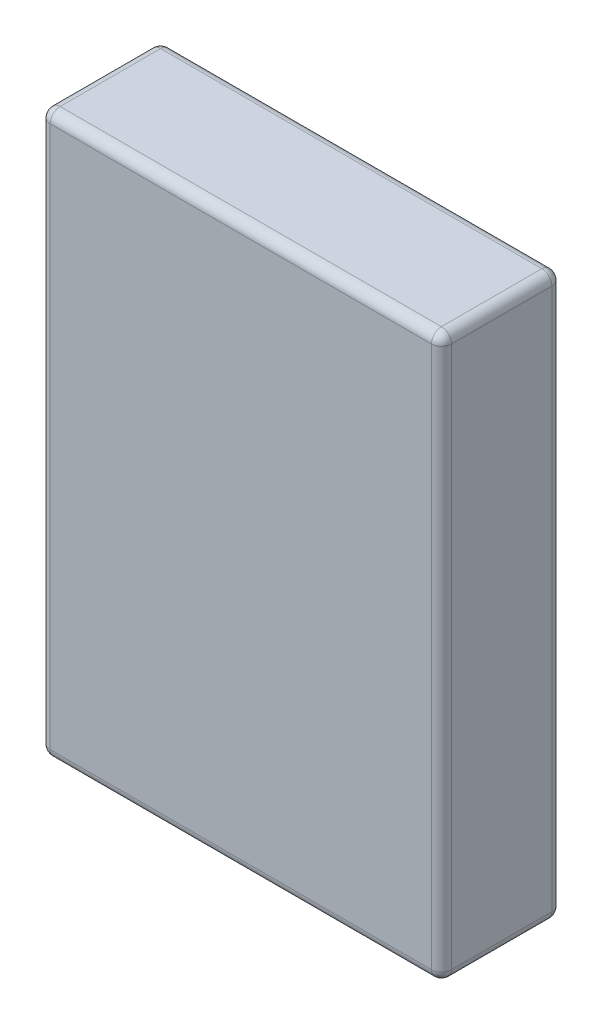
ISO-10303-21;
HEADER;
FILE_DESCRIPTION(('STEP AP214'),'2;1');
FILE_NAME('part.step','',(''),(''),'','','');
FILE_SCHEMA(('AUTOMOTIVE_DESIGN { 1 0 10303 214 1 1 1 1 }'));
ENDSEC;
DATA;
#1=APPLICATION_CONTEXT('core data for automotive mechanical design processes');
#2=APPLICATION_PROTOCOL_DEFINITION('international standard','automotive_design',2000,#1);
#3=PRODUCT_CONTEXT('',#1,'mechanical');
#4=PRODUCT('Part','Part','',(#3));
#5=PRODUCT_RELATED_PRODUCT_CATEGORY('part','',(#4));
#6=PRODUCT_DEFINITION_FORMATION('','',#4);
#7=PRODUCT_DEFINITION_CONTEXT('part definition',#1,'design');
#8=PRODUCT_DEFINITION('design','',#6,#7);
#9=PRODUCT_DEFINITION_SHAPE('','',#8);
#10=(LENGTH_UNIT() NAMED_UNIT(*) SI_UNIT(.MILLI.,.METRE.));
#11=(NAMED_UNIT(*) PLANE_ANGLE_UNIT() SI_UNIT($,.RADIAN.));
#12=(NAMED_UNIT(*) SI_UNIT($,.STERADIAN.) SOLID_ANGLE_UNIT());
#13=UNCERTAINTY_MEASURE_WITH_UNIT(LENGTH_MEASURE(1.E-05),#10,'distance_accuracy_value','');
#14=(GEOMETRIC_REPRESENTATION_CONTEXT(3) GLOBAL_UNCERTAINTY_ASSIGNED_CONTEXT((#13)) GLOBAL_UNIT_ASSIGNED_CONTEXT((#10,
#11,#12)) REPRESENTATION_CONTEXT('',''));
#15=CARTESIAN_POINT('',(0.,0.,0.));
#16=DIRECTION('',(0.,0.,1.));
#17=DIRECTION('',(1.,0.,0.));
#18=AXIS2_PLACEMENT_3D('',#15,#16,#17);
#19=CARTESIAN_POINT('',(63.5,88.9,38.1));
#20=DIRECTION('',(-1.,0.,0.));
#21=DIRECTION('',(0.,-1.,0.));
#22=AXIS2_PLACEMENT_3D('',#19,#20,#21);
#23=PLANE('',#22);
#24=DIRECTION('',(0.,0.,-1.));
#25=VECTOR('',#24,1.);
#26=CARTESIAN_POINT('',(63.5,85.725,38.1));
#27=LINE('',#26,#25);
#28=CARTESIAN_POINT('',(63.5,85.725,3.175));
#29=VERTEX_POINT('',#28);
#30=CARTESIAN_POINT('',(63.5,85.725,34.925));
#31=VERTEX_POINT('',#30);
#32=EDGE_CURVE('E127',#29,#31,#27,.F.);
#33=ORIENTED_EDGE('',*,*,#32,.T.);
#34=DIRECTION('',(0.,1.,0.));
#35=VECTOR('',#34,1.);
#36=CARTESIAN_POINT('',(63.5,-88.9,34.925));
#37=LINE('',#36,#35);
#38=CARTESIAN_POINT('',(63.5,-85.7249999999999,34.925));
#39=VERTEX_POINT('',#38);
#40=EDGE_CURVE('E164',#31,#39,#37,.F.);
#41=ORIENTED_EDGE('',*,*,#40,.T.);
#42=DIRECTION('',(0.,0.,-1.));
#43=VECTOR('',#42,1.);
#44=CARTESIAN_POINT('',(63.5,-85.7249999999999,38.1));
#45=LINE('',#44,#43);
#46=CARTESIAN_POINT('',(63.5,-85.7249999999999,3.175));
#47=VERTEX_POINT('',#46);
#48=EDGE_CURVE('E161',#39,#47,#45,.T.);
#49=ORIENTED_EDGE('',*,*,#48,.T.);
#50=DIRECTION('',(0.,1.,0.));
#51=VECTOR('',#50,1.);
#52=CARTESIAN_POINT('',(63.5,88.9,3.175));
#53=LINE('',#52,#51);
#54=EDGE_CURVE('E156',#47,#29,#53,.T.);
#55=ORIENTED_EDGE('',*,*,#54,.T.);
#56=EDGE_LOOP('',(#33,#41,#49,#55));
#57=FACE_BOUND('',#56,.T.);
#58=ADVANCED_FACE('F32',(#57),#23,.F.);
#59=CARTESIAN_POINT('',(-63.5,88.9,38.1));
#60=DIRECTION('',(0.,-1.,0.));
#61=DIRECTION('',(0.,0.,-1.));
#62=AXIS2_PLACEMENT_3D('',#59,#60,#61);
#63=PLANE('',#62);
#64=DIRECTION('',(0.,0.,-1.));
#65=VECTOR('',#64,1.);
#66=CARTESIAN_POINT('',(-60.325,88.9,38.1));
#67=LINE('',#66,#65);
#68=CARTESIAN_POINT('',(-60.325,88.9,3.175));
#69=VERTEX_POINT('',#68);
#70=CARTESIAN_POINT('',(-60.325,88.9,34.925));
#71=VERTEX_POINT('',#70);
#72=EDGE_CURVE('E149',#69,#71,#67,.F.);
#73=ORIENTED_EDGE('',*,*,#72,.T.);
#74=DIRECTION('',(-1.,0.,0.));
#75=VECTOR('',#74,1.);
#76=CARTESIAN_POINT('',(63.5,88.9,34.925));
#77=LINE('',#76,#75);
#78=CARTESIAN_POINT('',(60.325,88.9,34.925));
#79=VERTEX_POINT('',#78);
#80=EDGE_CURVE('E153',#71,#79,#77,.F.);
#81=ORIENTED_EDGE('',*,*,#80,.T.);
#82=DIRECTION('',(0.,0.,-1.));
#83=VECTOR('',#82,1.);
#84=CARTESIAN_POINT('',(60.325,88.9,38.1));
#85=LINE('',#84,#83);
#86=CARTESIAN_POINT('',(60.325,88.9,3.175));
#87=VERTEX_POINT('',#86);
#88=EDGE_CURVE('E125',#79,#87,#85,.T.);
#89=ORIENTED_EDGE('',*,*,#88,.T.);
#90=DIRECTION('',(-1.,0.,0.));
#91=VECTOR('',#90,1.);
#92=CARTESIAN_POINT('',(-63.5,88.9,3.175));
#93=LINE('',#92,#91);
#94=EDGE_CURVE('E143',#87,#69,#93,.T.);
#95=ORIENTED_EDGE('',*,*,#94,.T.);
#96=EDGE_LOOP('',(#73,#81,#89,#95));
#97=FACE_BOUND('',#96,.T.);
#98=ADVANCED_FACE('F151',(#97),#63,.F.);
#99=CARTESIAN_POINT('',(-63.5,88.9,38.1));
#100=DIRECTION('',(1.,0.,0.));
#101=DIRECTION('',(0.,1.,0.));
#102=AXIS2_PLACEMENT_3D('',#99,#100,#101);
#103=PLANE('',#102);
#104=DIRECTION('',(0.,0.,-1.));
#105=VECTOR('',#104,1.);
#106=CARTESIAN_POINT('',(-63.5,-85.725,38.1));
#107=LINE('',#106,#105);
#108=CARTESIAN_POINT('',(-63.5,-85.725,3.175));
#109=VERTEX_POINT('',#108);
#110=CARTESIAN_POINT('',(-63.5,-85.725,34.925));
#111=VERTEX_POINT('',#110);
#112=EDGE_CURVE('E168',#109,#111,#107,.F.);
#113=ORIENTED_EDGE('',*,*,#112,.T.);
#114=DIRECTION('',(0.,-1.,0.));
#115=VECTOR('',#114,1.);
#116=CARTESIAN_POINT('',(-63.5,88.9,34.925));
#117=LINE('',#116,#115);
#118=CARTESIAN_POINT('',(-63.5,85.725,34.925));
#119=VERTEX_POINT('',#118);
#120=EDGE_CURVE('E173',#111,#119,#117,.F.);
#121=ORIENTED_EDGE('',*,*,#120,.T.);
#122=DIRECTION('',(0.,0.,-1.));
#123=VECTOR('',#122,1.);
#124=CARTESIAN_POINT('',(-63.5,85.725,38.1));
#125=LINE('',#124,#123);
#126=CARTESIAN_POINT('',(-63.5,85.725,3.175));
#127=VERTEX_POINT('',#126);
#128=EDGE_CURVE('E170',#119,#127,#125,.T.);
#129=ORIENTED_EDGE('',*,*,#128,.T.);
#130=DIRECTION('',(0.,-1.,0.));
#131=VECTOR('',#130,1.);
#132=CARTESIAN_POINT('',(-63.5,88.9,3.175));
#133=LINE('',#132,#131);
#134=EDGE_CURVE('E166',#127,#109,#133,.T.);
#135=ORIENTED_EDGE('',*,*,#134,.T.);
#136=EDGE_LOOP('',(#113,#121,#129,#135));
#137=FACE_BOUND('',#136,.T.);
#138=ADVANCED_FACE('F278',(#137),#103,.F.);
#139=CARTESIAN_POINT('',(-63.5,-88.9,38.1));
#140=DIRECTION('',(0.,1.,0.));
#141=DIRECTION('',(0.,0.,1.));
#142=AXIS2_PLACEMENT_3D('',#139,#140,#141);
#143=PLANE('',#142);
#144=DIRECTION('',(0.,0.,-1.));
#145=VECTOR('',#144,1.);
#146=CARTESIAN_POINT('',(60.325,-88.9,38.1));
#147=LINE('',#146,#145);
#148=CARTESIAN_POINT('',(60.325,-88.9,3.175));
#149=VERTEX_POINT('',#148);
#150=CARTESIAN_POINT('',(60.325,-88.9,34.925));
#151=VERTEX_POINT('',#150);
#152=EDGE_CURVE('E177',#149,#151,#147,.F.);
#153=ORIENTED_EDGE('',*,*,#152,.T.);
#154=DIRECTION('',(1.,0.,0.));
#155=VECTOR('',#154,1.);
#156=CARTESIAN_POINT('',(-63.5,-88.9,34.925));
#157=LINE('',#156,#155);
#158=CARTESIAN_POINT('',(-60.325,-88.9,34.925));
#159=VERTEX_POINT('',#158);
#160=EDGE_CURVE('E182',#151,#159,#157,.F.);
#161=ORIENTED_EDGE('',*,*,#160,.T.);
#162=DIRECTION('',(0.,0.,-1.));
#163=VECTOR('',#162,1.);
#164=CARTESIAN_POINT('',(-60.325,-88.9,38.1));
#165=LINE('',#164,#163);
#166=CARTESIAN_POINT('',(-60.325,-88.9,3.175));
#167=VERTEX_POINT('',#166);
#168=EDGE_CURVE('E179',#159,#167,#165,.T.);
#169=ORIENTED_EDGE('',*,*,#168,.T.);
#170=DIRECTION('',(1.,0.,0.));
#171=VECTOR('',#170,1.);
#172=CARTESIAN_POINT('',(-63.5,-88.9,3.175));
#173=LINE('',#172,#171);
#174=EDGE_CURVE('E175',#167,#149,#173,.T.);
#175=ORIENTED_EDGE('',*,*,#174,.T.);
#176=EDGE_LOOP('',(#153,#161,#169,#175));
#177=FACE_BOUND('',#176,.T.);
#178=ADVANCED_FACE('F288',(#177),#143,.F.);
#179=CARTESIAN_POINT('',(63.5,-88.9,38.1));
#180=DIRECTION('',(0.,0.,1.));
#181=DIRECTION('',(1.,0.,0.));
#182=AXIS2_PLACEMENT_3D('',#179,#180,#181);
#183=PLANE('',#182);
#184=DIRECTION('',(0.,-1.,0.));
#185=VECTOR('',#184,1.);
#186=CARTESIAN_POINT('',(-60.325,-88.9,38.1));
#187=LINE('',#186,#185);
#188=CARTESIAN_POINT('',(-60.325,85.725,38.1));
#189=VERTEX_POINT('',#188);
#190=CARTESIAN_POINT('',(-60.325,-85.725,38.1));
#191=VERTEX_POINT('',#190);
#192=EDGE_CURVE('E188',#189,#191,#187,.T.);
#193=ORIENTED_EDGE('',*,*,#192,.T.);
#194=DIRECTION('',(1.,0.,0.));
#195=VECTOR('',#194,1.);
#196=CARTESIAN_POINT('',(63.5,-85.725,38.1));
#197=LINE('',#196,#195);
#198=CARTESIAN_POINT('',(60.325,-85.725,38.1));
#199=VERTEX_POINT('',#198);
#200=EDGE_CURVE('E190',#191,#199,#197,.T.);
#201=ORIENTED_EDGE('',*,*,#200,.T.);
#202=DIRECTION('',(0.,1.,0.));
#203=VECTOR('',#202,1.);
#204=CARTESIAN_POINT('',(60.325,88.9,38.1));
#205=LINE('',#204,#203);
#206=CARTESIAN_POINT('',(60.325,85.725,38.1));
#207=VERTEX_POINT('',#206);
#208=EDGE_CURVE('E184',#199,#207,#205,.T.);
#209=ORIENTED_EDGE('',*,*,#208,.T.);
#210=DIRECTION('',(-1.,0.,0.));
#211=VECTOR('',#210,1.);
#212=CARTESIAN_POINT('',(-63.5,85.725,38.1));
#213=LINE('',#212,#211);
#214=EDGE_CURVE('E186',#207,#189,#213,.T.);
#215=ORIENTED_EDGE('',*,*,#214,.T.);
#216=EDGE_LOOP('',(#193,#201,#209,#215));
#217=FACE_BOUND('',#216,.T.);
#218=ADVANCED_FACE('F270',(#217),#183,.T.);
#219=CARTESIAN_POINT('',(63.5,-88.9,0.));
#220=DIRECTION('',(0.,0.,1.));
#221=DIRECTION('',(1.,0.,0.));
#222=AXIS2_PLACEMENT_3D('',#219,#220,#221);
#223=PLANE('',#222);
#224=DIRECTION('',(0.,1.,0.));
#225=VECTOR('',#224,1.);
#226=CARTESIAN_POINT('',(60.325,-88.9,0.));
#227=LINE('',#226,#225);
#228=CARTESIAN_POINT('',(60.325,85.725,0.));
#229=VERTEX_POINT('',#228);
#230=CARTESIAN_POINT('',(60.325,-85.725,0.));
#231=VERTEX_POINT('',#230);
#232=EDGE_CURVE('E193',#229,#231,#227,.F.);
#233=ORIENTED_EDGE('',*,*,#232,.T.);
#234=DIRECTION('',(1.,0.,0.));
#235=VECTOR('',#234,1.);
#236=CARTESIAN_POINT('',(63.5,-85.725,0.));
#237=LINE('',#236,#235);
#238=CARTESIAN_POINT('',(-60.325,-85.725,0.));
#239=VERTEX_POINT('',#238);
#240=EDGE_CURVE('E11',#231,#239,#237,.F.);
#241=ORIENTED_EDGE('',*,*,#240,.T.);
#242=DIRECTION('',(0.,-1.,0.));
#243=VECTOR('',#242,1.);
#244=CARTESIAN_POINT('',(-60.325,-88.9,0.));
#245=LINE('',#244,#243);
#246=CARTESIAN_POINT('',(-60.325,85.725,0.));
#247=VERTEX_POINT('',#246);
#248=EDGE_CURVE('E41',#239,#247,#245,.F.);
#249=ORIENTED_EDGE('',*,*,#248,.T.);
#250=DIRECTION('',(-1.,0.,0.));
#251=VECTOR('',#250,1.);
#252=CARTESIAN_POINT('',(63.5,85.725,0.));
#253=LINE('',#252,#251);
#254=EDGE_CURVE('E195',#247,#229,#253,.F.);
#255=ORIENTED_EDGE('',*,*,#254,.T.);
#256=EDGE_LOOP('',(#233,#241,#249,#255));
#257=FACE_BOUND('',#256,.T.);
#258=ADVANCED_FACE('F477',(#257),#223,.F.);
#259=CARTESIAN_POINT('',(-60.325,-85.725,38.1));
#260=DIRECTION('',(0.,0.,-1.));
#261=DIRECTION('',(-1.,0.,0.));
#262=AXIS2_PLACEMENT_3D('',#259,#260,#261);
#263=CYLINDRICAL_SURFACE('',#262,3.175);
#264=CARTESIAN_POINT('',(-60.325,-85.725,34.925));
#265=DIRECTION('',(0.,0.,1.));
#266=DIRECTION('',(1.,0.,0.));
#267=AXIS2_PLACEMENT_3D('',#264,#265,#266);
#268=CIRCLE('',#267,3.175);
#269=EDGE_CURVE('E36',#111,#159,#268,.T.);
#270=ORIENTED_EDGE('',*,*,#269,.F.);
#271=ORIENTED_EDGE('',*,*,#112,.F.);
#272=CARTESIAN_POINT('',(-60.325,-85.725,3.175));
#273=DIRECTION('',(0.,0.,-1.));
#274=DIRECTION('',(-1.,0.,0.));
#275=AXIS2_PLACEMENT_3D('',#272,#273,#274);
#276=CIRCLE('',#275,3.175);
#277=EDGE_CURVE('E248',#167,#109,#276,.T.);
#278=ORIENTED_EDGE('',*,*,#277,.F.);
#279=ORIENTED_EDGE('',*,*,#168,.F.);
#280=EDGE_LOOP('',(#270,#271,#278,#279));
#281=FACE_BOUND('',#280,.T.);
#282=ADVANCED_FACE('F34',(#281),#263,.T.);
#283=CARTESIAN_POINT('',(-60.325,-85.725,34.925));
#284=DIRECTION('',(0.,0.,1.));
#285=DIRECTION('',(1.,0.,0.));
#286=AXIS2_PLACEMENT_3D('',#283,#284,#285);
#287=SPHERICAL_SURFACE('',#286,3.175);
#288=CARTESIAN_POINT('',(-60.325,-85.725,34.925));
#289=DIRECTION('',(0.,-1.,0.));
#290=DIRECTION('',(0.,0.,-1.));
#291=AXIS2_PLACEMENT_3D('',#288,#289,#290);
#292=CIRCLE('',#291,3.175);
#293=EDGE_CURVE('E243',#111,#191,#292,.F.);
#294=ORIENTED_EDGE('',*,*,#293,.F.);
#295=ORIENTED_EDGE('',*,*,#269,.T.);
#296=CARTESIAN_POINT('',(-60.325,-85.725,34.925));
#297=DIRECTION('',(-1.,0.,0.));
#298=DIRECTION('',(0.,0.,1.));
#299=AXIS2_PLACEMENT_3D('',#296,#297,#298);
#300=CIRCLE('',#299,3.175);
#301=EDGE_CURVE('E246',#191,#159,#300,.F.);
#302=ORIENTED_EDGE('',*,*,#301,.F.);
#303=EDGE_LOOP('',(#294,#295,#302));
#304=FACE_BOUND('',#303,.T.);
#305=ADVANCED_FACE('F258',(#304),#287,.T.);
#306=CARTESIAN_POINT('',(-60.325,-85.725,3.175));
#307=DIRECTION('',(0.,0.,1.));
#308=DIRECTION('',(1.,0.,0.));
#309=AXIS2_PLACEMENT_3D('',#306,#307,#308);
#310=SPHERICAL_SURFACE('',#309,3.175);
#311=CARTESIAN_POINT('',(-60.325,-85.725,3.175));
#312=DIRECTION('',(-1.,0.,0.));
#313=DIRECTION('',(0.,0.,1.));
#314=AXIS2_PLACEMENT_3D('',#311,#312,#313);
#315=CIRCLE('',#314,3.175);
#316=EDGE_CURVE('E238',#167,#239,#315,.F.);
#317=ORIENTED_EDGE('',*,*,#316,.F.);
#318=ORIENTED_EDGE('',*,*,#277,.T.);
#319=CARTESIAN_POINT('',(-60.325,-85.725,3.175));
#320=DIRECTION('',(0.,-1.,0.));
#321=DIRECTION('',(0.,0.,-1.));
#322=AXIS2_PLACEMENT_3D('',#319,#320,#321);
#323=CIRCLE('',#322,3.175);
#324=EDGE_CURVE('E241',#239,#109,#323,.F.);
#325=ORIENTED_EDGE('',*,*,#324,.F.);
#326=EDGE_LOOP('',(#317,#318,#325));
#327=FACE_BOUND('',#326,.T.);
#328=ADVANCED_FACE('F456',(#327),#310,.T.);
#329=CARTESIAN_POINT('',(63.5,-85.725,34.925));
#330=DIRECTION('',(-1.,0.,0.));
#331=DIRECTION('',(0.,0.,1.));
#332=AXIS2_PLACEMENT_3D('',#329,#330,#331);
#333=CYLINDRICAL_SURFACE('',#332,3.175);
#334=ORIENTED_EDGE('',*,*,#301,.T.);
#335=ORIENTED_EDGE('',*,*,#160,.F.);
#336=CARTESIAN_POINT('',(60.325,-85.725,34.925));
#337=DIRECTION('',(1.,0.,0.));
#338=DIRECTION('',(0.,0.,-1.));
#339=AXIS2_PLACEMENT_3D('',#336,#337,#338);
#340=CIRCLE('',#339,3.175);
#341=EDGE_CURVE('E232',#199,#151,#340,.T.);
#342=ORIENTED_EDGE('',*,*,#341,.F.);
#343=ORIENTED_EDGE('',*,*,#200,.F.);
#344=EDGE_LOOP('',(#334,#335,#342,#343));
#345=FACE_BOUND('',#344,.T.);
#346=ADVANCED_FACE('F266',(#345),#333,.T.);
#347=CARTESIAN_POINT('',(-60.325,-88.9,34.925));
#348=DIRECTION('',(0.,1.,0.));
#349=DIRECTION('',(-1.,0.,0.));
#350=AXIS2_PLACEMENT_3D('',#347,#348,#349);
#351=CYLINDRICAL_SURFACE('',#350,3.175);
#352=ORIENTED_EDGE('',*,*,#293,.T.);
#353=ORIENTED_EDGE('',*,*,#192,.F.);
#354=CARTESIAN_POINT('',(-60.325,85.725,34.925));
#355=DIRECTION('',(0.,1.,0.));
#356=DIRECTION('',(0.,0.,1.));
#357=AXIS2_PLACEMENT_3D('',#354,#355,#356);
#358=CIRCLE('',#357,3.175);
#359=EDGE_CURVE('E229',#119,#189,#358,.T.);
#360=ORIENTED_EDGE('',*,*,#359,.F.);
#361=ORIENTED_EDGE('',*,*,#120,.F.);
#362=EDGE_LOOP('',(#352,#353,#360,#361));
#363=FACE_BOUND('',#362,.T.);
#364=ADVANCED_FACE('F275',(#363),#351,.T.);
#365=CARTESIAN_POINT('',(-60.325,85.725,38.1));
#366=DIRECTION('',(0.,0.,-1.));
#367=DIRECTION('',(-1.,0.,0.));
#368=AXIS2_PLACEMENT_3D('',#365,#366,#367);
#369=CYLINDRICAL_SURFACE('',#368,3.175);
#370=CARTESIAN_POINT('',(-60.325,85.725,3.175));
#371=DIRECTION('',(0.,0.,-1.));
#372=DIRECTION('',(-1.,0.,0.));
#373=AXIS2_PLACEMENT_3D('',#370,#371,#372);
#374=CIRCLE('',#373,3.175);
#375=EDGE_CURVE('E223',#127,#69,#374,.T.);
#376=ORIENTED_EDGE('',*,*,#375,.F.);
#377=ORIENTED_EDGE('',*,*,#128,.F.);
#378=CARTESIAN_POINT('',(-60.325,85.725,34.925));
#379=DIRECTION('',(0.,0.,1.));
#380=DIRECTION('',(1.,0.,0.));
#381=AXIS2_PLACEMENT_3D('',#378,#379,#380);
#382=CIRCLE('',#381,3.175);
#383=EDGE_CURVE('E226',#71,#119,#382,.T.);
#384=ORIENTED_EDGE('',*,*,#383,.F.);
#385=ORIENTED_EDGE('',*,*,#72,.F.);
#386=EDGE_LOOP('',(#376,#377,#384,#385));
#387=FACE_BOUND('',#386,.T.);
#388=ADVANCED_FACE('F282',(#387),#369,.T.);
#389=CARTESIAN_POINT('',(-60.325,88.9,3.175));
#390=DIRECTION('',(0.,-1.,0.));
#391=DIRECTION('',(1.,0.,0.));
#392=AXIS2_PLACEMENT_3D('',#389,#390,#391);
#393=CYLINDRICAL_SURFACE('',#392,3.175);
#394=ORIENTED_EDGE('',*,*,#324,.T.);
#395=ORIENTED_EDGE('',*,*,#134,.F.);
#396=CARTESIAN_POINT('',(-60.325,85.725,3.175));
#397=DIRECTION('',(0.,1.,0.));
#398=DIRECTION('',(0.,0.,1.));
#399=AXIS2_PLACEMENT_3D('',#396,#397,#398);
#400=CIRCLE('',#399,3.175);
#401=EDGE_CURVE('E221',#247,#127,#400,.T.);
#402=ORIENTED_EDGE('',*,*,#401,.F.);
#403=ORIENTED_EDGE('',*,*,#248,.F.);
#404=EDGE_LOOP('',(#394,#395,#402,#403));
#405=FACE_BOUND('',#404,.T.);
#406=ADVANCED_FACE('F286',(#405),#393,.T.);
#407=CARTESIAN_POINT('',(-63.5,-85.725,3.175));
#408=DIRECTION('',(1.,0.,0.));
#409=DIRECTION('',(0.,0.,-1.));
#410=AXIS2_PLACEMENT_3D('',#407,#408,#409);
#411=CYLINDRICAL_SURFACE('',#410,3.175);
#412=ORIENTED_EDGE('',*,*,#316,.T.);
#413=ORIENTED_EDGE('',*,*,#240,.F.);
#414=CARTESIAN_POINT('',(60.325,-85.725,3.175));
#415=DIRECTION('',(1.,0.,0.));
#416=DIRECTION('',(0.,0.,-1.));
#417=AXIS2_PLACEMENT_3D('',#414,#415,#416);
#418=CIRCLE('',#417,3.175);
#419=EDGE_CURVE('E218',#149,#231,#418,.T.);
#420=ORIENTED_EDGE('',*,*,#419,.F.);
#421=ORIENTED_EDGE('',*,*,#174,.F.);
#422=EDGE_LOOP('',(#412,#413,#420,#421));
#423=FACE_BOUND('',#422,.T.);
#424=ADVANCED_FACE('F298',(#423),#411,.T.);
#425=CARTESIAN_POINT('',(60.325,-85.7249999999999,38.1));
#426=DIRECTION('',(0.,0.,-1.));
#427=DIRECTION('',(-1.,0.,0.));
#428=AXIS2_PLACEMENT_3D('',#425,#426,#427);
#429=CYLINDRICAL_SURFACE('',#428,3.175);
#430=CARTESIAN_POINT('',(60.325,-85.725,34.925));
#431=DIRECTION('',(0.,0.,1.));
#432=DIRECTION('',(1.,0.,0.));
#433=AXIS2_PLACEMENT_3D('',#430,#431,#432);
#434=CIRCLE('',#433,3.175);
#435=EDGE_CURVE('E235',#151,#39,#434,.T.);
#436=ORIENTED_EDGE('',*,*,#435,.F.);
#437=ORIENTED_EDGE('',*,*,#152,.F.);
#438=CARTESIAN_POINT('',(60.325,-85.7249999999999,3.175));
#439=DIRECTION('',(0.,0.,-1.));
#440=DIRECTION('',(-1.,0.,0.));
#441=AXIS2_PLACEMENT_3D('',#438,#439,#440);
#442=CIRCLE('',#441,3.175);
#443=EDGE_CURVE('E215',#47,#149,#442,.T.);
#444=ORIENTED_EDGE('',*,*,#443,.F.);
#445=ORIENTED_EDGE('',*,*,#48,.F.);
#446=EDGE_LOOP('',(#436,#437,#444,#445));
#447=FACE_BOUND('',#446,.T.);
#448=ADVANCED_FACE('F293',(#447),#429,.T.);
#449=CARTESIAN_POINT('',(60.325,-85.725,34.925));
#450=DIRECTION('',(0.,0.,1.));
#451=DIRECTION('',(1.,0.,0.));
#452=AXIS2_PLACEMENT_3D('',#449,#450,#451);
#453=SPHERICAL_SURFACE('',#452,3.175);
#454=ORIENTED_EDGE('',*,*,#341,.T.);
#455=ORIENTED_EDGE('',*,*,#435,.T.);
#456=CARTESIAN_POINT('',(60.325,-85.7249999999999,34.925));
#457=DIRECTION('',(0.,-1.,0.));
#458=DIRECTION('',(0.,0.,-1.));
#459=AXIS2_PLACEMENT_3D('',#456,#457,#458);
#460=CIRCLE('',#459,3.175);
#461=EDGE_CURVE('E212',#199,#39,#460,.F.);
#462=ORIENTED_EDGE('',*,*,#461,.F.);
#463=EDGE_LOOP('',(#454,#455,#462));
#464=FACE_BOUND('',#463,.T.);
#465=ADVANCED_FACE('F309',(#464),#453,.T.);
#466=CARTESIAN_POINT('',(-60.325,85.725,34.925));
#467=DIRECTION('',(0.,0.,1.));
#468=DIRECTION('',(1.,0.,0.));
#469=AXIS2_PLACEMENT_3D('',#466,#467,#468);
#470=SPHERICAL_SURFACE('',#469,3.175);
#471=ORIENTED_EDGE('',*,*,#383,.T.);
#472=ORIENTED_EDGE('',*,*,#359,.T.);
#473=CARTESIAN_POINT('',(-60.325,85.725,34.925));
#474=DIRECTION('',(-1.,0.,0.));
#475=DIRECTION('',(0.,0.,1.));
#476=AXIS2_PLACEMENT_3D('',#473,#474,#475);
#477=CIRCLE('',#476,3.175);
#478=EDGE_CURVE('E209',#71,#189,#477,.F.);
#479=ORIENTED_EDGE('',*,*,#478,.F.);
#480=EDGE_LOOP('',(#471,#472,#479));
#481=FACE_BOUND('',#480,.T.);
#482=ADVANCED_FACE('F319',(#481),#470,.T.);
#483=CARTESIAN_POINT('',(-60.325,85.725,3.175));
#484=DIRECTION('',(0.,0.,1.));
#485=DIRECTION('',(1.,0.,0.));
#486=AXIS2_PLACEMENT_3D('',#483,#484,#485);
#487=SPHERICAL_SURFACE('',#486,3.175);
#488=ORIENTED_EDGE('',*,*,#401,.T.);
#489=ORIENTED_EDGE('',*,*,#375,.T.);
#490=CARTESIAN_POINT('',(-60.325,85.725,3.175));
#491=DIRECTION('',(-1.,0.,0.));
#492=DIRECTION('',(0.,0.,1.));
#493=AXIS2_PLACEMENT_3D('',#490,#491,#492);
#494=CIRCLE('',#493,3.175);
#495=EDGE_CURVE('E146',#247,#69,#494,.F.);
#496=ORIENTED_EDGE('',*,*,#495,.F.);
#497=EDGE_LOOP('',(#488,#489,#496));
#498=FACE_BOUND('',#497,.T.);
#499=ADVANCED_FACE('F321',(#498),#487,.T.);
#500=CARTESIAN_POINT('',(60.325,-85.725,3.175));
#501=DIRECTION('',(0.,0.,1.));
#502=DIRECTION('',(1.,0.,0.));
#503=AXIS2_PLACEMENT_3D('',#500,#501,#502);
#504=SPHERICAL_SURFACE('',#503,3.175);
#505=ORIENTED_EDGE('',*,*,#443,.T.);
#506=ORIENTED_EDGE('',*,*,#419,.T.);
#507=CARTESIAN_POINT('',(60.325,-85.725,3.175));
#508=DIRECTION('',(0.,-1.,0.));
#509=DIRECTION('',(1.,0.,0.));
#510=AXIS2_PLACEMENT_3D('',#507,#508,#509);
#511=CIRCLE('',#510,3.175);
#512=EDGE_CURVE('E205',#47,#231,#511,.F.);
#513=ORIENTED_EDGE('',*,*,#512,.F.);
#514=EDGE_LOOP('',(#505,#506,#513));
#515=FACE_BOUND('',#514,.T.);
#516=ADVANCED_FACE('F300',(#515),#504,.T.);
#517=CARTESIAN_POINT('',(60.325,-88.9,34.925));
#518=DIRECTION('',(0.,-1.,0.));
#519=DIRECTION('',(1.,0.,0.));
#520=AXIS2_PLACEMENT_3D('',#517,#518,#519);
#521=CYLINDRICAL_SURFACE('',#520,3.175);
#522=ORIENTED_EDGE('',*,*,#461,.T.);
#523=ORIENTED_EDGE('',*,*,#40,.F.);
#524=CARTESIAN_POINT('',(60.325,85.725,34.925));
#525=DIRECTION('',(0.,1.,0.));
#526=DIRECTION('',(-1.,0.,0.));
#527=AXIS2_PLACEMENT_3D('',#524,#525,#526);
#528=CIRCLE('',#527,3.175);
#529=EDGE_CURVE('E202',#207,#31,#528,.T.);
#530=ORIENTED_EDGE('',*,*,#529,.F.);
#531=ORIENTED_EDGE('',*,*,#208,.F.);
#532=EDGE_LOOP('',(#522,#523,#530,#531));
#533=FACE_BOUND('',#532,.T.);
#534=ADVANCED_FACE('F311',(#533),#521,.T.);
#535=CARTESIAN_POINT('',(63.5,85.725,34.925));
#536=DIRECTION('',(1.,0.,0.));
#537=DIRECTION('',(0.,0.,-1.));
#538=AXIS2_PLACEMENT_3D('',#535,#536,#537);
#539=CYLINDRICAL_SURFACE('',#538,3.175);
#540=ORIENTED_EDGE('',*,*,#478,.T.);
#541=ORIENTED_EDGE('',*,*,#214,.F.);
#542=CARTESIAN_POINT('',(60.325,85.725,34.925));
#543=DIRECTION('',(1.,0.,0.));
#544=DIRECTION('',(0.,0.,-1.));
#545=AXIS2_PLACEMENT_3D('',#542,#543,#544);
#546=CIRCLE('',#545,3.175);
#547=EDGE_CURVE('E140',#79,#207,#546,.T.);
#548=ORIENTED_EDGE('',*,*,#547,.F.);
#549=ORIENTED_EDGE('',*,*,#80,.F.);
#550=EDGE_LOOP('',(#540,#541,#548,#549));
#551=FACE_BOUND('',#550,.T.);
#552=ADVANCED_FACE('F317',(#551),#539,.T.);
#553=CARTESIAN_POINT('',(-63.5,85.725,3.175));
#554=DIRECTION('',(-1.,0.,0.));
#555=DIRECTION('',(0.,0.,1.));
#556=AXIS2_PLACEMENT_3D('',#553,#554,#555);
#557=CYLINDRICAL_SURFACE('',#556,3.175);
#558=ORIENTED_EDGE('',*,*,#495,.T.);
#559=ORIENTED_EDGE('',*,*,#94,.F.);
#560=CARTESIAN_POINT('',(60.325,85.725,3.175));
#561=DIRECTION('',(1.,0.,0.));
#562=DIRECTION('',(0.,0.,-1.));
#563=AXIS2_PLACEMENT_3D('',#560,#561,#562);
#564=CIRCLE('',#563,3.175);
#565=EDGE_CURVE('E133',#229,#87,#564,.T.);
#566=ORIENTED_EDGE('',*,*,#565,.F.);
#567=ORIENTED_EDGE('',*,*,#254,.F.);
#568=EDGE_LOOP('',(#558,#559,#566,#567));
#569=FACE_BOUND('',#568,.T.);
#570=ADVANCED_FACE('F144',(#569),#557,.T.);
#571=CARTESIAN_POINT('',(60.325,88.9,3.175));
#572=DIRECTION('',(0.,1.,0.));
#573=DIRECTION('',(-1.,0.,0.));
#574=AXIS2_PLACEMENT_3D('',#571,#572,#573);
#575=CYLINDRICAL_SURFACE('',#574,3.175);
#576=ORIENTED_EDGE('',*,*,#512,.T.);
#577=ORIENTED_EDGE('',*,*,#232,.F.);
#578=CARTESIAN_POINT('',(60.325,85.725,3.175));
#579=DIRECTION('',(0.,1.,0.));
#580=DIRECTION('',(0.,0.,1.));
#581=AXIS2_PLACEMENT_3D('',#578,#579,#580);
#582=CIRCLE('',#581,3.175);
#583=EDGE_CURVE('E137',#29,#229,#582,.T.);
#584=ORIENTED_EDGE('',*,*,#583,.F.);
#585=ORIENTED_EDGE('',*,*,#54,.F.);
#586=EDGE_LOOP('',(#576,#577,#584,#585));
#587=FACE_BOUND('',#586,.T.);
#588=ADVANCED_FACE('F304',(#587),#575,.T.);
#589=CARTESIAN_POINT('',(60.325,85.725,34.925));
#590=DIRECTION('',(0.,0.,1.));
#591=DIRECTION('',(1.,0.,0.));
#592=AXIS2_PLACEMENT_3D('',#589,#590,#591);
#593=SPHERICAL_SURFACE('',#592,3.175);
#594=ORIENTED_EDGE('',*,*,#547,.T.);
#595=ORIENTED_EDGE('',*,*,#529,.T.);
#596=CARTESIAN_POINT('',(60.325,85.725,34.925));
#597=DIRECTION('',(0.,0.,1.));
#598=DIRECTION('',(1.,0.,0.));
#599=AXIS2_PLACEMENT_3D('',#596,#597,#598);
#600=CIRCLE('',#599,3.175);
#601=EDGE_CURVE('E130',#79,#31,#600,.F.);
#602=ORIENTED_EDGE('',*,*,#601,.F.);
#603=EDGE_LOOP('',(#594,#595,#602));
#604=FACE_BOUND('',#603,.T.);
#605=ADVANCED_FACE('F315',(#604),#593,.T.);
#606=CARTESIAN_POINT('',(60.325,85.725,3.175));
#607=DIRECTION('',(0.,0.,1.));
#608=DIRECTION('',(1.,0.,0.));
#609=AXIS2_PLACEMENT_3D('',#606,#607,#608);
#610=SPHERICAL_SURFACE('',#609,3.175);
#611=ORIENTED_EDGE('',*,*,#583,.T.);
#612=ORIENTED_EDGE('',*,*,#565,.T.);
#613=CARTESIAN_POINT('',(60.325,85.725,3.175));
#614=DIRECTION('',(0.,0.,-1.));
#615=DIRECTION('',(-1.,0.,0.));
#616=AXIS2_PLACEMENT_3D('',#613,#614,#615);
#617=CIRCLE('',#616,3.175);
#618=EDGE_CURVE('E121',#29,#87,#617,.F.);
#619=ORIENTED_EDGE('',*,*,#618,.F.);
#620=EDGE_LOOP('',(#611,#612,#619));
#621=FACE_BOUND('',#620,.T.);
#622=ADVANCED_FACE('F135',(#621),#610,.T.);
#623=CARTESIAN_POINT('',(60.325,85.725,38.1));
#624=DIRECTION('',(0.,0.,-1.));
#625=DIRECTION('',(-1.,0.,0.));
#626=AXIS2_PLACEMENT_3D('',#623,#624,#625);
#627=CYLINDRICAL_SURFACE('',#626,3.175);
#628=ORIENTED_EDGE('',*,*,#601,.T.);
#629=ORIENTED_EDGE('',*,*,#32,.F.);
#630=ORIENTED_EDGE('',*,*,#618,.T.);
#631=ORIENTED_EDGE('',*,*,#88,.F.);
#632=EDGE_LOOP('',(#628,#629,#630,#631));
#633=FACE_BOUND('',#632,.T.);
#634=ADVANCED_FACE('F123',(#633),#627,.T.);
#635=CLOSED_SHELL('',(#58,#98,#138,#178,#218,#258,#282,#305,#328,#346,#364,#388,#406,#424,#448,
#465,#482,#499,#516,#534,#552,#570,#588,#605,#622,#634));
#636=MANIFOLD_SOLID_BREP('B2',#635);
#637=ADVANCED_BREP_SHAPE_REPRESENTATION('',(#18,#636),#14);
#638=SHAPE_DEFINITION_REPRESENTATION(#9,#637);
ENDSEC;
END-ISO-10303-21;
